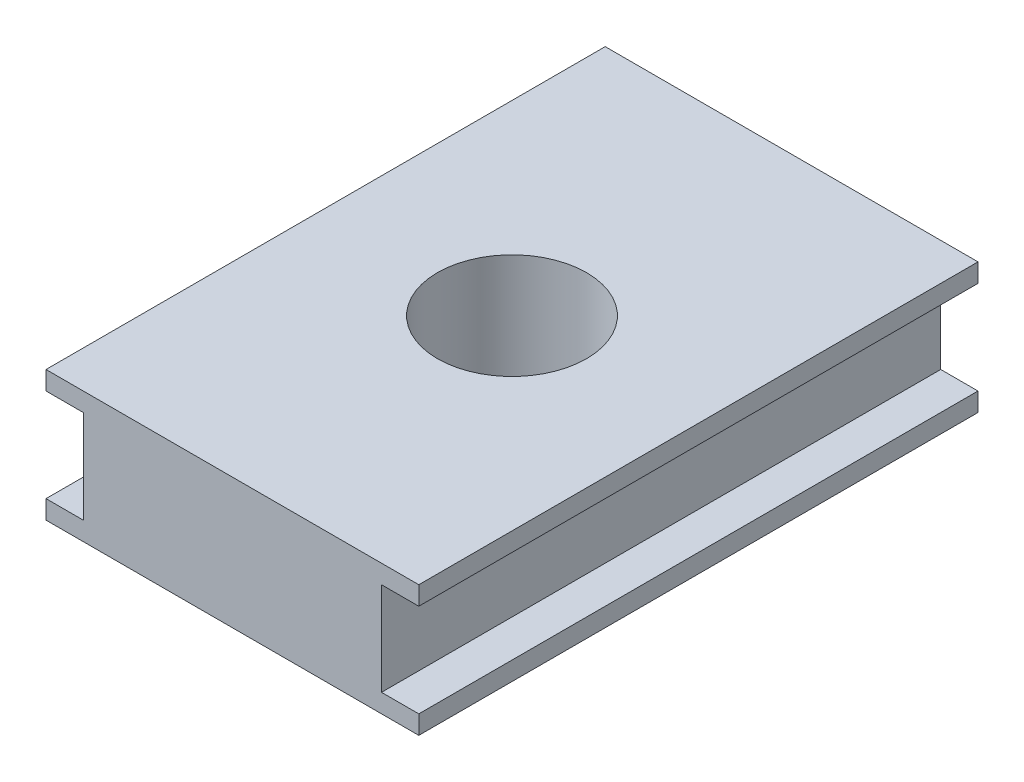
ISO-10303-21;
HEADER;
FILE_DESCRIPTION(('STEP AP214'),'2;1');
FILE_NAME('part.step','',(''),(''),'','','');
FILE_SCHEMA(('AUTOMOTIVE_DESIGN { 1 0 10303 214 1 1 1 1 }'));
ENDSEC;
DATA;
#1=APPLICATION_CONTEXT('core data for automotive mechanical design processes');
#2=APPLICATION_PROTOCOL_DEFINITION('international standard','automotive_design',2000,#1);
#3=PRODUCT_CONTEXT('',#1,'mechanical');
#4=PRODUCT('Part','Part','',(#3));
#5=PRODUCT_RELATED_PRODUCT_CATEGORY('part','',(#4));
#6=PRODUCT_DEFINITION_FORMATION('','',#4);
#7=PRODUCT_DEFINITION_CONTEXT('part definition',#1,'design');
#8=PRODUCT_DEFINITION('design','',#6,#7);
#9=PRODUCT_DEFINITION_SHAPE('','',#8);
#10=(LENGTH_UNIT() NAMED_UNIT(*) SI_UNIT(.MILLI.,.METRE.));
#11=(NAMED_UNIT(*) PLANE_ANGLE_UNIT() SI_UNIT($,.RADIAN.));
#12=(NAMED_UNIT(*) SI_UNIT($,.STERADIAN.) SOLID_ANGLE_UNIT());
#13=UNCERTAINTY_MEASURE_WITH_UNIT(LENGTH_MEASURE(1.E-05),#10,'distance_accuracy_value','');
#14=(GEOMETRIC_REPRESENTATION_CONTEXT(3) GLOBAL_UNCERTAINTY_ASSIGNED_CONTEXT((#13)) GLOBAL_UNIT_ASSIGNED_CONTEXT((#10,
#11,#12)) REPRESENTATION_CONTEXT('',''));
#15=CARTESIAN_POINT('',(0.,0.,0.));
#16=DIRECTION('',(0.,0.,1.));
#17=DIRECTION('',(1.,0.,0.));
#18=AXIS2_PLACEMENT_3D('',#15,#16,#17);
#19=CARTESIAN_POINT('',(-10.,7.,15.));
#20=DIRECTION('',(1.,0.,0.));
#21=DIRECTION('',(0.,0.,-1.));
#22=AXIS2_PLACEMENT_3D('',#19,#20,#21);
#23=PLANE('',#22);
#24=DIRECTION('',(0.,-1.,0.));
#25=VECTOR('',#24,1.);
#26=CARTESIAN_POINT('',(-10.,7.,15.));
#27=LINE('',#26,#25);
#28=CARTESIAN_POINT('',(-10.,1.,15.));
#29=VERTEX_POINT('',#28);
#30=CARTESIAN_POINT('',(-10.,0.,15.));
#31=VERTEX_POINT('',#30);
#32=EDGE_CURVE('E199',#29,#31,#27,.T.);
#33=ORIENTED_EDGE('',*,*,#32,.F.);
#34=DIRECTION('',(0.,0.,1.));
#35=VECTOR('',#34,1.);
#36=CARTESIAN_POINT('',(-10.,1.,-15.));
#37=LINE('',#36,#35);
#38=CARTESIAN_POINT('',(-10.,1.,-15.));
#39=VERTEX_POINT('',#38);
#40=EDGE_CURVE('E138',#39,#29,#37,.T.);
#41=ORIENTED_EDGE('',*,*,#40,.F.);
#42=DIRECTION('',(0.,-1.,0.));
#43=VECTOR('',#42,1.);
#44=CARTESIAN_POINT('',(-10.,7.,-15.));
#45=LINE('',#44,#43);
#46=CARTESIAN_POINT('',(-10.,0.,-15.));
#47=VERTEX_POINT('',#46);
#48=EDGE_CURVE('E201',#39,#47,#45,.T.);
#49=ORIENTED_EDGE('',*,*,#48,.T.);
#50=DIRECTION('',(0.,0.,1.));
#51=VECTOR('',#50,1.);
#52=CARTESIAN_POINT('',(-10.,0.,15.));
#53=LINE('',#52,#51);
#54=EDGE_CURVE('E191',#47,#31,#53,.T.);
#55=ORIENTED_EDGE('',*,*,#54,.T.);
#56=EDGE_LOOP('',(#33,#41,#49,#55));
#57=FACE_BOUND('',#56,.T.);
#58=ADVANCED_FACE('F33',(#57),#23,.F.);
#59=CARTESIAN_POINT('',(10.,7.,15.));
#60=DIRECTION('',(-1.,0.,0.));
#61=DIRECTION('',(0.,0.,1.));
#62=AXIS2_PLACEMENT_3D('',#59,#60,#61);
#63=PLANE('',#62);
#64=DIRECTION('',(0.,-1.,0.));
#65=VECTOR('',#64,1.);
#66=CARTESIAN_POINT('',(10.,7.,-15.));
#67=LINE('',#66,#65);
#68=CARTESIAN_POINT('',(10.,1.,-15.));
#69=VERTEX_POINT('',#68);
#70=CARTESIAN_POINT('',(10.,0.,-15.));
#71=VERTEX_POINT('',#70);
#72=EDGE_CURVE('E42',#69,#71,#67,.T.);
#73=ORIENTED_EDGE('',*,*,#72,.F.);
#74=DIRECTION('',(0.,0.,-1.));
#75=VECTOR('',#74,1.);
#76=CARTESIAN_POINT('',(10.,1.,15.));
#77=LINE('',#76,#75);
#78=CARTESIAN_POINT('',(10.,1.,15.));
#79=VERTEX_POINT('',#78);
#80=EDGE_CURVE('E153',#79,#69,#77,.T.);
#81=ORIENTED_EDGE('',*,*,#80,.F.);
#82=DIRECTION('',(0.,-1.,0.));
#83=VECTOR('',#82,1.);
#84=CARTESIAN_POINT('',(10.,7.,15.));
#85=LINE('',#84,#83);
#86=CARTESIAN_POINT('',(10.,0.,15.));
#87=VERTEX_POINT('',#86);
#88=EDGE_CURVE('E185',#79,#87,#85,.T.);
#89=ORIENTED_EDGE('',*,*,#88,.T.);
#90=DIRECTION('',(0.,0.,-1.));
#91=VECTOR('',#90,1.);
#92=CARTESIAN_POINT('',(10.,0.,15.));
#93=LINE('',#92,#91);
#94=EDGE_CURVE('E168',#87,#71,#93,.T.);
#95=ORIENTED_EDGE('',*,*,#94,.T.);
#96=EDGE_LOOP('',(#73,#81,#89,#95));
#97=FACE_BOUND('',#96,.T.);
#98=ADVANCED_FACE('F254',(#97),#63,.F.);
#99=CARTESIAN_POINT('',(10.,7.,15.));
#100=VERTEX_POINT('',#99);
#101=CARTESIAN_POINT('',(10.,6.,15.));
#102=VERTEX_POINT('',#101);
#103=EDGE_CURVE('E196',#100,#102,#85,.T.);
#104=ORIENTED_EDGE('',*,*,#103,.T.);
#105=DIRECTION('',(0.,0.,1.));
#106=VECTOR('',#105,1.);
#107=CARTESIAN_POINT('',(10.,6.,15.));
#108=LINE('',#107,#106);
#109=CARTESIAN_POINT('',(10.,6.,-15.));
#110=VERTEX_POINT('',#109);
#111=EDGE_CURVE('E161',#110,#102,#108,.T.);
#112=ORIENTED_EDGE('',*,*,#111,.F.);
#113=CARTESIAN_POINT('',(10.,7.,-15.));
#114=VERTEX_POINT('',#113);
#115=EDGE_CURVE('E11',#114,#110,#67,.T.);
#116=ORIENTED_EDGE('',*,*,#115,.F.);
#117=DIRECTION('',(0.,0.,-1.));
#118=VECTOR('',#117,1.);
#119=CARTESIAN_POINT('',(10.,7.,15.));
#120=LINE('',#119,#118);
#121=EDGE_CURVE('E175',#100,#114,#120,.T.);
#122=ORIENTED_EDGE('',*,*,#121,.F.);
#123=EDGE_LOOP('',(#104,#112,#116,#122));
#124=FACE_BOUND('',#123,.T.);
#125=ADVANCED_FACE('F35',(#124),#63,.F.);
#126=CARTESIAN_POINT('',(-10.,7.,-15.));
#127=DIRECTION('',(0.,0.,1.));
#128=DIRECTION('',(1.,0.,0.));
#129=AXIS2_PLACEMENT_3D('',#126,#127,#128);
#130=PLANE('',#129);
#131=ORIENTED_EDGE('',*,*,#48,.F.);
#132=DIRECTION('',(-1.,0.,0.));
#133=VECTOR('',#132,1.);
#134=CARTESIAN_POINT('',(-8.,1.,-15.));
#135=LINE('',#134,#133);
#136=CARTESIAN_POINT('',(-8.,1.,-15.));
#137=VERTEX_POINT('',#136);
#138=EDGE_CURVE('E146',#137,#39,#135,.T.);
#139=ORIENTED_EDGE('',*,*,#138,.F.);
#140=DIRECTION('',(0.,-1.,0.));
#141=VECTOR('',#140,1.);
#142=CARTESIAN_POINT('',(-8.,1.,-15.));
#143=LINE('',#142,#141);
#144=CARTESIAN_POINT('',(-8.,6.,-15.));
#145=VERTEX_POINT('',#144);
#146=EDGE_CURVE('E131',#145,#137,#143,.T.);
#147=ORIENTED_EDGE('',*,*,#146,.F.);
#148=DIRECTION('',(-1.,0.,0.));
#149=VECTOR('',#148,1.);
#150=CARTESIAN_POINT('',(-8.,6.,-15.));
#151=LINE('',#150,#149);
#152=CARTESIAN_POINT('',(-10.,6.,-15.));
#153=VERTEX_POINT('',#152);
#154=EDGE_CURVE('E129',#145,#153,#151,.T.);
#155=ORIENTED_EDGE('',*,*,#154,.T.);
#156=CARTESIAN_POINT('',(-10.,7.,-15.));
#157=VERTEX_POINT('',#156);
#158=EDGE_CURVE('E202',#157,#153,#45,.T.);
#159=ORIENTED_EDGE('',*,*,#158,.F.);
#160=DIRECTION('',(-1.,0.,0.));
#161=VECTOR('',#160,1.);
#162=CARTESIAN_POINT('',(-10.,7.,-15.));
#163=LINE('',#162,#161);
#164=EDGE_CURVE('E178',#114,#157,#163,.T.);
#165=ORIENTED_EDGE('',*,*,#164,.F.);
#166=ORIENTED_EDGE('',*,*,#115,.T.);
#167=DIRECTION('',(1.,0.,0.));
#168=VECTOR('',#167,1.);
#169=CARTESIAN_POINT('',(8.,6.,-15.));
#170=LINE('',#169,#168);
#171=CARTESIAN_POINT('',(8.,6.,-15.));
#172=VERTEX_POINT('',#171);
#173=EDGE_CURVE('E160',#172,#110,#170,.T.);
#174=ORIENTED_EDGE('',*,*,#173,.F.);
#175=DIRECTION('',(0.,1.,0.));
#176=VECTOR('',#175,1.);
#177=CARTESIAN_POINT('',(8.,1.,-15.));
#178=LINE('',#177,#176);
#179=CARTESIAN_POINT('',(8.,1.,-15.));
#180=VERTEX_POINT('',#179);
#181=EDGE_CURVE('E151',#180,#172,#178,.T.);
#182=ORIENTED_EDGE('',*,*,#181,.F.);
#183=DIRECTION('',(1.,0.,0.));
#184=VECTOR('',#183,1.);
#185=CARTESIAN_POINT('',(8.,1.,-15.));
#186=LINE('',#185,#184);
#187=EDGE_CURVE('E165',#180,#69,#186,.T.);
#188=ORIENTED_EDGE('',*,*,#187,.T.);
#189=ORIENTED_EDGE('',*,*,#72,.T.);
#190=DIRECTION('',(-1.,0.,0.));
#191=VECTOR('',#190,1.);
#192=CARTESIAN_POINT('',(-10.,0.,-15.));
#193=LINE('',#192,#191);
#194=EDGE_CURVE('E188',#71,#47,#193,.T.);
#195=ORIENTED_EDGE('',*,*,#194,.T.);
#196=EDGE_LOOP('',(#131,#139,#147,#155,#159,#165,#166,#174,#182,#188,#189,#195));
#197=FACE_BOUND('',#196,.T.);
#198=ADVANCED_FACE('F216',(#197),#130,.F.);
#199=ORIENTED_EDGE('',*,*,#158,.T.);
#200=DIRECTION('',(0.,0.,-1.));
#201=VECTOR('',#200,1.);
#202=CARTESIAN_POINT('',(-10.,6.,-15.));
#203=LINE('',#202,#201);
#204=CARTESIAN_POINT('',(-10.,6.,15.));
#205=VERTEX_POINT('',#204);
#206=EDGE_CURVE('E227',#205,#153,#203,.T.);
#207=ORIENTED_EDGE('',*,*,#206,.F.);
#208=CARTESIAN_POINT('',(-10.,7.,15.));
#209=VERTEX_POINT('',#208);
#210=EDGE_CURVE('E144',#209,#205,#27,.T.);
#211=ORIENTED_EDGE('',*,*,#210,.F.);
#212=DIRECTION('',(0.,0.,1.));
#213=VECTOR('',#212,1.);
#214=CARTESIAN_POINT('',(-10.,7.,15.));
#215=LINE('',#214,#213);
#216=EDGE_CURVE('E181',#157,#209,#215,.T.);
#217=ORIENTED_EDGE('',*,*,#216,.F.);
#218=EDGE_LOOP('',(#199,#207,#211,#217));
#219=FACE_BOUND('',#218,.T.);
#220=ADVANCED_FACE('F256',(#219),#23,.F.);
#221=CARTESIAN_POINT('',(-10.,7.,15.));
#222=DIRECTION('',(0.,0.,-1.));
#223=DIRECTION('',(-1.,0.,0.));
#224=AXIS2_PLACEMENT_3D('',#221,#222,#223);
#225=PLANE('',#224);
#226=DIRECTION('',(0.,1.,0.));
#227=VECTOR('',#226,1.);
#228=CARTESIAN_POINT('',(-8.,1.,15.));
#229=LINE('',#228,#227);
#230=CARTESIAN_POINT('',(-8.,1.,15.));
#231=VERTEX_POINT('',#230);
#232=CARTESIAN_POINT('',(-8.,6.,15.));
#233=VERTEX_POINT('',#232);
#234=EDGE_CURVE('E132',#231,#233,#229,.T.);
#235=ORIENTED_EDGE('',*,*,#234,.F.);
#236=DIRECTION('',(-1.,0.,0.));
#237=VECTOR('',#236,1.);
#238=CARTESIAN_POINT('',(-8.,1.,15.));
#239=LINE('',#238,#237);
#240=EDGE_CURVE('E163',#231,#29,#239,.T.);
#241=ORIENTED_EDGE('',*,*,#240,.T.);
#242=ORIENTED_EDGE('',*,*,#32,.T.);
#243=DIRECTION('',(1.,0.,0.));
#244=VECTOR('',#243,1.);
#245=CARTESIAN_POINT('',(-10.,0.,15.));
#246=LINE('',#245,#244);
#247=EDGE_CURVE('E179',#31,#87,#246,.T.);
#248=ORIENTED_EDGE('',*,*,#247,.T.);
#249=ORIENTED_EDGE('',*,*,#88,.F.);
#250=DIRECTION('',(1.,0.,0.));
#251=VECTOR('',#250,1.);
#252=CARTESIAN_POINT('',(8.,1.,15.));
#253=LINE('',#252,#251);
#254=CARTESIAN_POINT('',(8.,1.,15.));
#255=VERTEX_POINT('',#254);
#256=EDGE_CURVE('E169',#255,#79,#253,.T.);
#257=ORIENTED_EDGE('',*,*,#256,.F.);
#258=DIRECTION('',(0.,-1.,0.));
#259=VECTOR('',#258,1.);
#260=CARTESIAN_POINT('',(8.,1.,15.));
#261=LINE('',#260,#259);
#262=CARTESIAN_POINT('',(8.,6.,15.));
#263=VERTEX_POINT('',#262);
#264=EDGE_CURVE('E155',#263,#255,#261,.T.);
#265=ORIENTED_EDGE('',*,*,#264,.F.);
#266=DIRECTION('',(1.,0.,0.));
#267=VECTOR('',#266,1.);
#268=CARTESIAN_POINT('',(8.,6.,15.));
#269=LINE('',#268,#267);
#270=EDGE_CURVE('E171',#263,#102,#269,.T.);
#271=ORIENTED_EDGE('',*,*,#270,.T.);
#272=ORIENTED_EDGE('',*,*,#103,.F.);
#273=DIRECTION('',(1.,0.,0.));
#274=VECTOR('',#273,1.);
#275=CARTESIAN_POINT('',(-10.,7.,15.));
#276=LINE('',#275,#274);
#277=EDGE_CURVE('E183',#209,#100,#276,.T.);
#278=ORIENTED_EDGE('',*,*,#277,.F.);
#279=ORIENTED_EDGE('',*,*,#210,.T.);
#280=DIRECTION('',(-1.,0.,0.));
#281=VECTOR('',#280,1.);
#282=CARTESIAN_POINT('',(-8.,6.,15.));
#283=LINE('',#282,#281);
#284=EDGE_CURVE('E126',#233,#205,#283,.T.);
#285=ORIENTED_EDGE('',*,*,#284,.F.);
#286=EDGE_LOOP('',(#235,#241,#242,#248,#249,#257,#265,#271,#272,#278,#279,#285));
#287=FACE_BOUND('',#286,.T.);
#288=ADVANCED_FACE('F141',(#287),#225,.F.);
#289=CARTESIAN_POINT('',(0.,7.,0.));
#290=DIRECTION('',(0.,-1.,0.));
#291=DIRECTION('',(0.,0.,-1.));
#292=AXIS2_PLACEMENT_3D('',#289,#290,#291);
#293=PLANE('',#292);
#294=CARTESIAN_POINT('',(0.,7.,0.));
#295=DIRECTION('',(0.,1.,0.));
#296=DIRECTION('',(0.,0.,1.));
#297=AXIS2_PLACEMENT_3D('',#294,#295,#296);
#298=CIRCLE('',#297,4.);
#299=CARTESIAN_POINT('',(0.,7.,4.));
#300=VERTEX_POINT('',#299);
#301=EDGE_CURVE('E230',#300,#300,#298,.T.);
#302=ORIENTED_EDGE('',*,*,#301,.F.);
#303=EDGE_LOOP('',(#302));
#304=FACE_BOUND('',#303,.T.);
#305=ORIENTED_EDGE('',*,*,#121,.T.);
#306=ORIENTED_EDGE('',*,*,#164,.T.);
#307=ORIENTED_EDGE('',*,*,#216,.T.);
#308=ORIENTED_EDGE('',*,*,#277,.T.);
#309=EDGE_LOOP('',(#305,#306,#307,#308));
#310=FACE_BOUND('',#309,.T.);
#311=ADVANCED_FACE('F241',(#304,#310),#293,.F.);
#312=CARTESIAN_POINT('',(0.,0.,0.));
#313=DIRECTION('',(0.,-1.,0.));
#314=DIRECTION('',(0.,0.,-1.));
#315=AXIS2_PLACEMENT_3D('',#312,#313,#314);
#316=PLANE('',#315);
#317=CARTESIAN_POINT('',(0.,0.,0.));
#318=DIRECTION('',(0.,-1.,0.));
#319=DIRECTION('',(0.,0.,-1.));
#320=AXIS2_PLACEMENT_3D('',#317,#318,#319);
#321=CIRCLE('',#320,4.);
#322=CARTESIAN_POINT('',(0.,0.,-4.));
#323=VERTEX_POINT('',#322);
#324=EDGE_CURVE('E37',#323,#323,#321,.T.);
#325=ORIENTED_EDGE('',*,*,#324,.F.);
#326=EDGE_LOOP('',(#325));
#327=FACE_BOUND('',#326,.T.);
#328=ORIENTED_EDGE('',*,*,#94,.F.);
#329=ORIENTED_EDGE('',*,*,#247,.F.);
#330=ORIENTED_EDGE('',*,*,#54,.F.);
#331=ORIENTED_EDGE('',*,*,#194,.F.);
#332=EDGE_LOOP('',(#328,#329,#330,#331));
#333=FACE_BOUND('',#332,.T.);
#334=ADVANCED_FACE('F220',(#327,#333),#316,.T.);
#335=CARTESIAN_POINT('',(8.,1.,15.));
#336=DIRECTION('',(0.,-1.,0.));
#337=DIRECTION('',(0.,0.,-1.));
#338=AXIS2_PLACEMENT_3D('',#335,#336,#337);
#339=PLANE('',#338);
#340=ORIENTED_EDGE('',*,*,#80,.T.);
#341=ORIENTED_EDGE('',*,*,#187,.F.);
#342=DIRECTION('',(0.,0.,-1.));
#343=VECTOR('',#342,1.);
#344=CARTESIAN_POINT('',(8.,1.,15.));
#345=LINE('',#344,#343);
#346=EDGE_CURVE('E157',#255,#180,#345,.T.);
#347=ORIENTED_EDGE('',*,*,#346,.F.);
#348=ORIENTED_EDGE('',*,*,#256,.T.);
#349=EDGE_LOOP('',(#340,#341,#347,#348));
#350=FACE_BOUND('',#349,.T.);
#351=ADVANCED_FACE('F240',(#350),#339,.F.);
#352=CARTESIAN_POINT('',(8.,6.,15.));
#353=DIRECTION('',(0.,1.,0.));
#354=DIRECTION('',(0.,0.,1.));
#355=AXIS2_PLACEMENT_3D('',#352,#353,#354);
#356=PLANE('',#355);
#357=ORIENTED_EDGE('',*,*,#111,.T.);
#358=ORIENTED_EDGE('',*,*,#270,.F.);
#359=DIRECTION('',(0.,0.,1.));
#360=VECTOR('',#359,1.);
#361=CARTESIAN_POINT('',(8.,6.,15.));
#362=LINE('',#361,#360);
#363=EDGE_CURVE('E57',#172,#263,#362,.T.);
#364=ORIENTED_EDGE('',*,*,#363,.F.);
#365=ORIENTED_EDGE('',*,*,#173,.T.);
#366=EDGE_LOOP('',(#357,#358,#364,#365));
#367=FACE_BOUND('',#366,.T.);
#368=ADVANCED_FACE('F247',(#367),#356,.F.);
#369=CARTESIAN_POINT('',(8.,0.,0.));
#370=DIRECTION('',(-1.,0.,0.));
#371=DIRECTION('',(0.,0.,1.));
#372=AXIS2_PLACEMENT_3D('',#369,#370,#371);
#373=PLANE('',#372);
#374=ORIENTED_EDGE('',*,*,#181,.T.);
#375=ORIENTED_EDGE('',*,*,#363,.T.);
#376=ORIENTED_EDGE('',*,*,#264,.T.);
#377=ORIENTED_EDGE('',*,*,#346,.T.);
#378=EDGE_LOOP('',(#374,#375,#376,#377));
#379=FACE_BOUND('',#378,.T.);
#380=ADVANCED_FACE('F283',(#379),#373,.F.);
#381=CARTESIAN_POINT('',(-8.,1.,-15.));
#382=DIRECTION('',(0.,-1.,0.));
#383=DIRECTION('',(0.,0.,-1.));
#384=AXIS2_PLACEMENT_3D('',#381,#382,#383);
#385=PLANE('',#384);
#386=ORIENTED_EDGE('',*,*,#40,.T.);
#387=ORIENTED_EDGE('',*,*,#240,.F.);
#388=DIRECTION('',(0.,0.,1.));
#389=VECTOR('',#388,1.);
#390=CARTESIAN_POINT('',(-8.,1.,-15.));
#391=LINE('',#390,#389);
#392=EDGE_CURVE('E49',#137,#231,#391,.T.);
#393=ORIENTED_EDGE('',*,*,#392,.F.);
#394=ORIENTED_EDGE('',*,*,#138,.T.);
#395=EDGE_LOOP('',(#386,#387,#393,#394));
#396=FACE_BOUND('',#395,.T.);
#397=ADVANCED_FACE('F281',(#396),#385,.F.);
#398=CARTESIAN_POINT('',(-8.,6.,-15.));
#399=DIRECTION('',(0.,1.,0.));
#400=DIRECTION('',(0.,0.,1.));
#401=AXIS2_PLACEMENT_3D('',#398,#399,#400);
#402=PLANE('',#401);
#403=ORIENTED_EDGE('',*,*,#206,.T.);
#404=ORIENTED_EDGE('',*,*,#154,.F.);
#405=DIRECTION('',(0.,0.,-1.));
#406=VECTOR('',#405,1.);
#407=CARTESIAN_POINT('',(-8.,6.,-15.));
#408=LINE('',#407,#406);
#409=EDGE_CURVE('E123',#233,#145,#408,.T.);
#410=ORIENTED_EDGE('',*,*,#409,.F.);
#411=ORIENTED_EDGE('',*,*,#284,.T.);
#412=EDGE_LOOP('',(#403,#404,#410,#411));
#413=FACE_BOUND('',#412,.T.);
#414=ADVANCED_FACE('F124',(#413),#402,.F.);
#415=CARTESIAN_POINT('',(-8.,0.,0.));
#416=DIRECTION('',(1.,0.,0.));
#417=DIRECTION('',(0.,0.,-1.));
#418=AXIS2_PLACEMENT_3D('',#415,#416,#417);
#419=PLANE('',#418);
#420=ORIENTED_EDGE('',*,*,#234,.T.);
#421=ORIENTED_EDGE('',*,*,#409,.T.);
#422=ORIENTED_EDGE('',*,*,#146,.T.);
#423=ORIENTED_EDGE('',*,*,#392,.T.);
#424=EDGE_LOOP('',(#420,#421,#422,#423));
#425=FACE_BOUND('',#424,.T.);
#426=ADVANCED_FACE('F135',(#425),#419,.F.);
#427=CARTESIAN_POINT('',(0.,-3.,0.));
#428=DIRECTION('',(0.,1.,0.));
#429=DIRECTION('',(0.,0.,1.));
#430=AXIS2_PLACEMENT_3D('',#427,#428,#429);
#431=CYLINDRICAL_SURFACE('',#430,4.);
#432=ORIENTED_EDGE('',*,*,#324,.T.);
#433=EDGE_LOOP('',(#432));
#434=FACE_BOUND('',#433,.T.);
#435=ORIENTED_EDGE('',*,*,#301,.T.);
#436=EDGE_LOOP('',(#435));
#437=FACE_BOUND('',#436,.T.);
#438=ADVANCED_FACE('F237',(#434,#437),#431,.F.);
#439=CLOSED_SHELL('',(#58,#98,#125,#198,#220,#288,#311,#334,#351,#368,#380,#397,#414,#426,#438));
#440=MANIFOLD_SOLID_BREP('B2',#439);
#441=ADVANCED_BREP_SHAPE_REPRESENTATION('',(#18,#440),#14);
#442=SHAPE_DEFINITION_REPRESENTATION(#9,#441);
ENDSEC;
END-ISO-10303-21;
